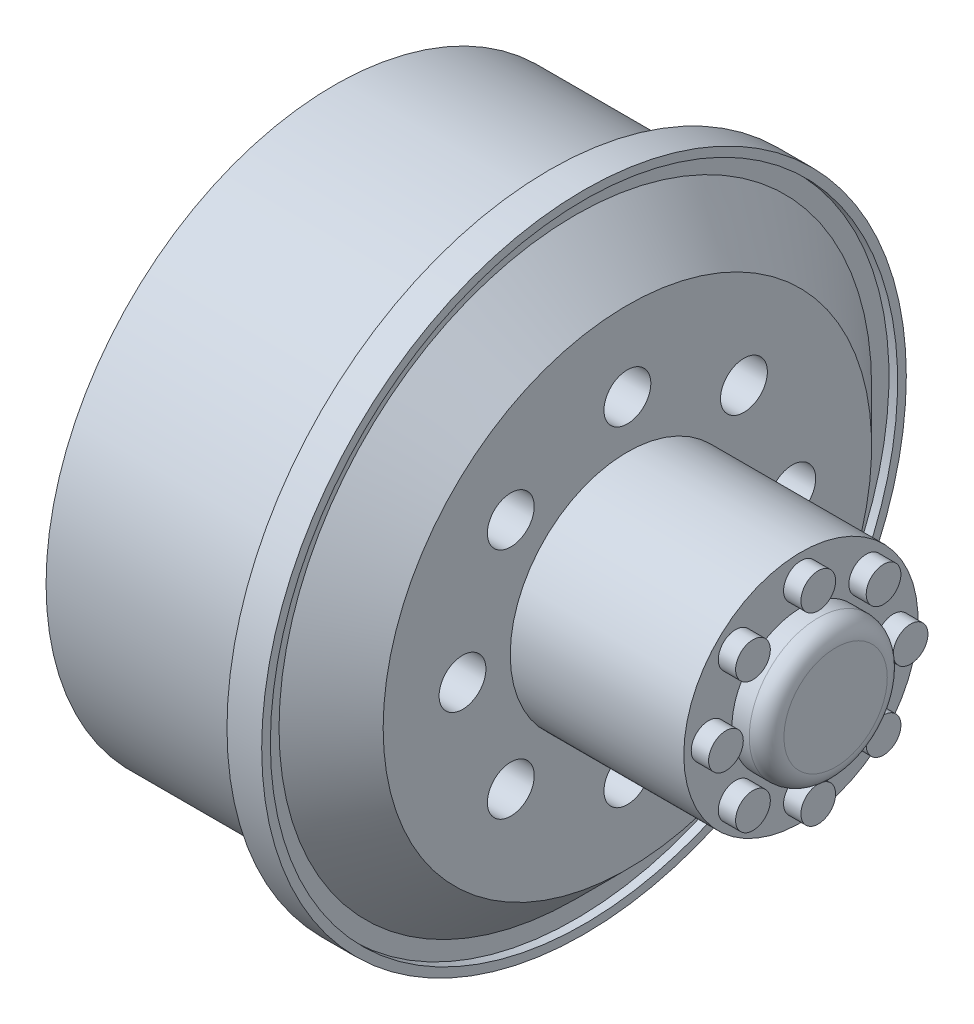
ISO-10303-21;
HEADER;
FILE_DESCRIPTION(('STEP AP214'),'2;1');
FILE_NAME('part.step','',(''),(''),'','','');
FILE_SCHEMA(('AUTOMOTIVE_DESIGN { 1 0 10303 214 1 1 1 1 }'));
ENDSEC;
DATA;
#1=APPLICATION_CONTEXT('core data for automotive mechanical design processes');
#2=APPLICATION_PROTOCOL_DEFINITION('international standard','automotive_design',2000,#1);
#3=PRODUCT_CONTEXT('',#1,'mechanical');
#4=PRODUCT('Part','Part','',(#3));
#5=PRODUCT_RELATED_PRODUCT_CATEGORY('part','',(#4));
#6=PRODUCT_DEFINITION_FORMATION('','',#4);
#7=PRODUCT_DEFINITION_CONTEXT('part definition',#1,'design');
#8=PRODUCT_DEFINITION('design','',#6,#7);
#9=PRODUCT_DEFINITION_SHAPE('','',#8);
#10=(LENGTH_UNIT() NAMED_UNIT(*) SI_UNIT(.MILLI.,.METRE.));
#11=(NAMED_UNIT(*) PLANE_ANGLE_UNIT() SI_UNIT($,.RADIAN.));
#12=(NAMED_UNIT(*) SI_UNIT($,.STERADIAN.) SOLID_ANGLE_UNIT());
#13=UNCERTAINTY_MEASURE_WITH_UNIT(LENGTH_MEASURE(1.E-05),#10,'distance_accuracy_value','');
#14=(GEOMETRIC_REPRESENTATION_CONTEXT(3) GLOBAL_UNCERTAINTY_ASSIGNED_CONTEXT((#13)) GLOBAL_UNIT_ASSIGNED_CONTEXT((#10,
#11,#12)) REPRESENTATION_CONTEXT('',''));
#15=CARTESIAN_POINT('',(0.,0.,0.));
#16=DIRECTION('',(0.,0.,1.));
#17=DIRECTION('',(1.,0.,0.));
#18=AXIS2_PLACEMENT_3D('',#15,#16,#17);
#19=CARTESIAN_POINT('',(19.5913772135329,5.32066793579194,0.));
#20=DIRECTION('',(-1.,0.,0.));
#21=DIRECTION('',(0.,0.,1.));
#22=AXIS2_PLACEMENT_3D('',#19,#20,#21);
#23=CYLINDRICAL_SURFACE('',#22,1.);
#24=CARTESIAN_POINT('',(17.5913772135329,5.32066793579194,0.));
#25=DIRECTION('',(-1.,0.,0.));
#26=DIRECTION('',(0.,0.,1.));
#27=AXIS2_PLACEMENT_3D('',#24,#25,#26);
#28=CIRCLE('',#27,1.);
#29=CARTESIAN_POINT('',(17.5913772135329,5.32066793579194,1.));
#30=VERTEX_POINT('',#29);
#31=EDGE_CURVE('E66',#30,#30,#28,.F.);
#32=ORIENTED_EDGE('',*,*,#31,.T.);
#33=EDGE_LOOP('',(#32));
#34=FACE_BOUND('',#33,.T.);
#35=CARTESIAN_POINT('',(18.5913772135329,5.32066793579194,0.));
#36=DIRECTION('',(1.,0.,0.));
#37=DIRECTION('',(0.,0.,-1.));
#38=AXIS2_PLACEMENT_3D('',#35,#36,#37);
#39=CIRCLE('',#38,1.);
#40=CARTESIAN_POINT('',(18.5913772135329,5.32066793579194,-1.));
#41=VERTEX_POINT('',#40);
#42=EDGE_CURVE('E138',#41,#41,#39,.T.);
#43=ORIENTED_EDGE('',*,*,#42,.F.);
#44=EDGE_LOOP('',(#43));
#45=FACE_BOUND('',#44,.T.);
#46=ADVANCED_FACE('F31',(#34,#45),#23,.T.);
#47=CARTESIAN_POINT('',(19.5913772135329,3.76228037784047,-3.76228037784037));
#48=DIRECTION('',(-1.,0.,0.));
#49=DIRECTION('',(0.,0.,1.));
#50=AXIS2_PLACEMENT_3D('',#47,#48,#49);
#51=CYLINDRICAL_SURFACE('',#50,1.00000000000003);
#52=CARTESIAN_POINT('',(17.5913772135329,3.76228037784047,-3.76228037784037));
#53=DIRECTION('',(-1.,0.,0.));
#54=DIRECTION('',(0.,0.,1.));
#55=AXIS2_PLACEMENT_3D('',#52,#53,#54);
#56=CIRCLE('',#55,1.00000000000003);
#57=CARTESIAN_POINT('',(17.5913772135329,3.76228037784047,-2.76228037784035));
#58=VERTEX_POINT('',#57);
#59=EDGE_CURVE('E63',#58,#58,#56,.F.);
#60=ORIENTED_EDGE('',*,*,#59,.T.);
#61=EDGE_LOOP('',(#60));
#62=FACE_BOUND('',#61,.T.);
#63=CARTESIAN_POINT('',(18.5913772135329,3.76228037784047,-3.76228037784037));
#64=DIRECTION('',(1.,0.,0.));
#65=DIRECTION('',(0.,0.,-1.));
#66=AXIS2_PLACEMENT_3D('',#63,#64,#65);
#67=CIRCLE('',#66,1.00000000000003);
#68=CARTESIAN_POINT('',(18.5913772135329,3.76228037784047,-4.7622803778404));
#69=VERTEX_POINT('',#68);
#70=EDGE_CURVE('E162',#69,#69,#67,.T.);
#71=ORIENTED_EDGE('',*,*,#70,.F.);
#72=EDGE_LOOP('',(#71));
#73=FACE_BOUND('',#72,.T.);
#74=ADVANCED_FACE('F186',(#62,#73),#51,.T.);
#75=CARTESIAN_POINT('',(19.5913772135329,2.25856326226585E-13,-5.32066793579216));
#76=DIRECTION('',(-1.,0.,0.));
#77=DIRECTION('',(0.,0.,1.));
#78=AXIS2_PLACEMENT_3D('',#75,#76,#77);
#79=CYLINDRICAL_SURFACE('',#78,1.00000000000017);
#80=CARTESIAN_POINT('',(17.5913772135329,2.25856326226585E-13,-5.32066793579216));
#81=DIRECTION('',(-1.,0.,0.));
#82=DIRECTION('',(0.,0.,1.));
#83=AXIS2_PLACEMENT_3D('',#80,#81,#82);
#84=CIRCLE('',#83,1.00000000000017);
#85=CARTESIAN_POINT('',(17.5913772135329,2.25856326226585E-13,-4.32066793579199));
#86=VERTEX_POINT('',#85);
#87=EDGE_CURVE('E60',#86,#86,#84,.F.);
#88=ORIENTED_EDGE('',*,*,#87,.T.);
#89=EDGE_LOOP('',(#88));
#90=FACE_BOUND('',#89,.T.);
#91=CARTESIAN_POINT('',(18.5913772135329,2.25856326226585E-13,-5.32066793579216));
#92=DIRECTION('',(1.,0.,0.));
#93=DIRECTION('',(0.,0.,-1.));
#94=AXIS2_PLACEMENT_3D('',#91,#92,#93);
#95=CIRCLE('',#94,1.00000000000017);
#96=CARTESIAN_POINT('',(18.5913772135329,2.25856326226585E-13,-6.32066793579233));
#97=VERTEX_POINT('',#96);
#98=EDGE_CURVE('E178',#97,#97,#95,.T.);
#99=ORIENTED_EDGE('',*,*,#98,.F.);
#100=EDGE_LOOP('',(#99));
#101=FACE_BOUND('',#100,.T.);
#102=ADVANCED_FACE('F188',(#90,#101),#79,.T.);
#103=CARTESIAN_POINT('',(19.5913772135329,-3.76228037784015,-3.76228037784069));
#104=DIRECTION('',(-1.,0.,0.));
#105=DIRECTION('',(0.,0.,1.));
#106=AXIS2_PLACEMENT_3D('',#103,#104,#105);
#107=CYLINDRICAL_SURFACE('',#106,1.00000000000035);
#108=CARTESIAN_POINT('',(17.5913772135329,-3.76228037784015,-3.76228037784069));
#109=DIRECTION('',(-1.,0.,0.));
#110=DIRECTION('',(0.,0.,1.));
#111=AXIS2_PLACEMENT_3D('',#108,#109,#110);
#112=CIRCLE('',#111,1.00000000000035);
#113=CARTESIAN_POINT('',(17.5913772135329,-3.76228037784015,-2.76228037784035));
#114=VERTEX_POINT('',#113);
#115=EDGE_CURVE('E57',#114,#114,#112,.F.);
#116=ORIENTED_EDGE('',*,*,#115,.T.);
#117=EDGE_LOOP('',(#116));
#118=FACE_BOUND('',#117,.T.);
#119=CARTESIAN_POINT('',(18.5913772135329,-3.76228037784015,-3.76228037784069));
#120=DIRECTION('',(1.,0.,0.));
#121=DIRECTION('',(0.,0.,-1.));
#122=AXIS2_PLACEMENT_3D('',#119,#120,#121);
#123=CIRCLE('',#122,1.00000000000035);
#124=CARTESIAN_POINT('',(18.5913772135329,-3.76228037784015,-4.76228037784104));
#125=VERTEX_POINT('',#124);
#126=EDGE_CURVE('E175',#125,#125,#123,.T.);
#127=ORIENTED_EDGE('',*,*,#126,.F.);
#128=EDGE_LOOP('',(#127));
#129=FACE_BOUND('',#128,.T.);
#130=ADVANCED_FACE('F195',(#118,#129),#107,.T.);
#131=CARTESIAN_POINT('',(19.5913772135329,-5.32066793579194,-4.5171265245317E-13));
#132=DIRECTION('',(-1.,0.,0.));
#133=DIRECTION('',(0.,0.,1.));
#134=AXIS2_PLACEMENT_3D('',#131,#132,#133);
#135=CYLINDRICAL_SURFACE('',#134,1.00000000000047);
#136=CARTESIAN_POINT('',(17.5913772135329,-5.32066793579194,-4.5171265245317E-13));
#137=DIRECTION('',(-1.,0.,0.));
#138=DIRECTION('',(0.,0.,1.));
#139=AXIS2_PLACEMENT_3D('',#136,#137,#138);
#140=CIRCLE('',#139,1.00000000000047);
#141=CARTESIAN_POINT('',(17.5913772135329,-5.32066793579194,1.00000000000002));
#142=VERTEX_POINT('',#141);
#143=EDGE_CURVE('E54',#142,#142,#140,.F.);
#144=ORIENTED_EDGE('',*,*,#143,.T.);
#145=EDGE_LOOP('',(#144));
#146=FACE_BOUND('',#145,.T.);
#147=CARTESIAN_POINT('',(18.5913772135329,-5.32066793579194,-4.5171265245317E-13));
#148=DIRECTION('',(1.,0.,0.));
#149=DIRECTION('',(0.,0.,-1.));
#150=AXIS2_PLACEMENT_3D('',#147,#148,#149);
#151=CIRCLE('',#150,1.00000000000047);
#152=CARTESIAN_POINT('',(18.5913772135329,-5.32066793579194,-1.00000000000092));
#153=VERTEX_POINT('',#152);
#154=EDGE_CURVE('E172',#153,#153,#151,.T.);
#155=ORIENTED_EDGE('',*,*,#154,.F.);
#156=EDGE_LOOP('',(#155));
#157=FACE_BOUND('',#156,.T.);
#158=ADVANCED_FACE('F338',(#146,#157),#135,.T.);
#159=CARTESIAN_POINT('',(19.5913772135329,-3.76228037784047,3.76228037783992));
#160=DIRECTION('',(-1.,0.,0.));
#161=DIRECTION('',(0.,0.,1.));
#162=AXIS2_PLACEMENT_3D('',#159,#160,#161);
#163=CYLINDRICAL_SURFACE('',#162,1.00000000000046);
#164=CARTESIAN_POINT('',(17.5913772135329,-3.76228037784047,3.76228037783992));
#165=DIRECTION('',(-1.,0.,0.));
#166=DIRECTION('',(0.,0.,1.));
#167=AXIS2_PLACEMENT_3D('',#164,#165,#166);
#168=CIRCLE('',#167,1.00000000000046);
#169=CARTESIAN_POINT('',(17.5913772135329,-3.76228037784047,4.76228037784038));
#170=VERTEX_POINT('',#169);
#171=EDGE_CURVE('E51',#170,#170,#168,.F.);
#172=ORIENTED_EDGE('',*,*,#171,.T.);
#173=EDGE_LOOP('',(#172));
#174=FACE_BOUND('',#173,.T.);
#175=CARTESIAN_POINT('',(18.5913772135329,-3.76228037784047,3.76228037783992));
#176=DIRECTION('',(1.,0.,0.));
#177=DIRECTION('',(0.,0.,-1.));
#178=AXIS2_PLACEMENT_3D('',#175,#176,#177);
#179=CIRCLE('',#178,1.00000000000046);
#180=CARTESIAN_POINT('',(18.5913772135329,-3.76228037784047,2.76228037783947));
#181=VERTEX_POINT('',#180);
#182=EDGE_CURVE('E169',#181,#181,#179,.T.);
#183=ORIENTED_EDGE('',*,*,#182,.F.);
#184=EDGE_LOOP('',(#183));
#185=FACE_BOUND('',#184,.T.);
#186=ADVANCED_FACE('F328',(#174,#185),#163,.T.);
#187=CARTESIAN_POINT('',(19.5913772135329,-2.26507920122274E-13,5.32066793579171));
#188=DIRECTION('',(-1.,0.,0.));
#189=DIRECTION('',(0.,0.,1.));
#190=AXIS2_PLACEMENT_3D('',#187,#188,#189);
#191=CYLINDRICAL_SURFACE('',#190,1.00000000000034);
#192=CARTESIAN_POINT('',(17.5913772135329,-2.26507920122274E-13,5.32066793579171));
#193=DIRECTION('',(-1.,0.,0.));
#194=DIRECTION('',(0.,0.,1.));
#195=AXIS2_PLACEMENT_3D('',#192,#193,#194);
#196=CIRCLE('',#195,1.00000000000034);
#197=CARTESIAN_POINT('',(17.5913772135329,-2.26507920122274E-13,6.32066793579205));
#198=VERTEX_POINT('',#197);
#199=EDGE_CURVE('E46',#198,#198,#196,.F.);
#200=ORIENTED_EDGE('',*,*,#199,.T.);
#201=EDGE_LOOP('',(#200));
#202=FACE_BOUND('',#201,.T.);
#203=CARTESIAN_POINT('',(18.5913772135329,-2.26507920122274E-13,5.32066793579171));
#204=DIRECTION('',(1.,0.,0.));
#205=DIRECTION('',(0.,0.,-1.));
#206=AXIS2_PLACEMENT_3D('',#203,#204,#205);
#207=CIRCLE('',#206,1.00000000000033);
#208=CARTESIAN_POINT('',(18.5913772135329,-2.26507920122274E-13,4.32066793579138));
#209=VERTEX_POINT('',#208);
#210=EDGE_CURVE('E166',#209,#209,#207,.T.);
#211=ORIENTED_EDGE('',*,*,#210,.F.);
#212=EDGE_LOOP('',(#211));
#213=FACE_BOUND('',#212,.T.);
#214=ADVANCED_FACE('F298',(#202,#213),#191,.T.);
#215=CARTESIAN_POINT('',(19.5913772135329,3.76228037784015,3.76228037784024));
#216=DIRECTION('',(-1.,0.,0.));
#217=DIRECTION('',(0.,0.,1.));
#218=AXIS2_PLACEMENT_3D('',#215,#216,#217);
#219=CYLINDRICAL_SURFACE('',#218,1.00000000000017);
#220=CARTESIAN_POINT('',(17.5913772135329,3.76228037784015,3.76228037784024));
#221=DIRECTION('',(-1.,0.,0.));
#222=DIRECTION('',(0.,0.,1.));
#223=AXIS2_PLACEMENT_3D('',#220,#221,#222);
#224=CIRCLE('',#223,1.00000000000017);
#225=CARTESIAN_POINT('',(17.5913772135329,3.76228037784015,4.76228037784042));
#226=VERTEX_POINT('',#225);
#227=EDGE_CURVE('E42',#226,#226,#224,.F.);
#228=ORIENTED_EDGE('',*,*,#227,.T.);
#229=EDGE_LOOP('',(#228));
#230=FACE_BOUND('',#229,.T.);
#231=CARTESIAN_POINT('',(18.5913772135329,3.76228037784015,3.76228037784024));
#232=DIRECTION('',(1.,0.,0.));
#233=DIRECTION('',(0.,0.,-1.));
#234=AXIS2_PLACEMENT_3D('',#231,#232,#233);
#235=CIRCLE('',#234,1.00000000000017);
#236=CARTESIAN_POINT('',(18.5913772135329,3.76228037784015,2.76228037784007));
#237=VERTEX_POINT('',#236);
#238=EDGE_CURVE('E163',#237,#237,#235,.T.);
#239=ORIENTED_EDGE('',*,*,#238,.F.);
#240=EDGE_LOOP('',(#239));
#241=FACE_BOUND('',#240,.T.);
#242=ADVANCED_FACE('F293',(#230,#241),#219,.T.);
#243=CARTESIAN_POINT('',(-9.30862278646706,14.6,0.));
#244=DIRECTION('',(1.,0.,0.));
#245=DIRECTION('',(0.,0.,-1.));
#246=AXIS2_PLACEMENT_3D('',#243,#244,#245);
#247=PLANE('',#246);
#248=CARTESIAN_POINT('',(-9.30862278646706,0.,0.));
#249=DIRECTION('',(-1.,0.,0.));
#250=DIRECTION('',(0.,0.,1.));
#251=AXIS2_PLACEMENT_3D('',#248,#249,#250);
#252=CIRCLE('',#251,14.6);
#253=CARTESIAN_POINT('',(-9.30862278646706,0.,14.6));
#254=VERTEX_POINT('',#253);
#255=EDGE_CURVE('E106',#254,#254,#252,.T.);
#256=ORIENTED_EDGE('',*,*,#255,.F.);
#257=EDGE_LOOP('',(#256));
#258=FACE_BOUND('',#257,.T.);
#259=CARTESIAN_POINT('',(-9.30862278646706,0.,0.));
#260=DIRECTION('',(-1.,0.,0.));
#261=DIRECTION('',(0.,0.,1.));
#262=AXIS2_PLACEMENT_3D('',#259,#260,#261);
#263=CIRCLE('',#262,16.6);
#264=CARTESIAN_POINT('',(-9.30862278646706,0.,16.6));
#265=VERTEX_POINT('',#264);
#266=EDGE_CURVE('E70',#265,#265,#263,.T.);
#267=ORIENTED_EDGE('',*,*,#266,.T.);
#268=EDGE_LOOP('',(#267));
#269=FACE_BOUND('',#268,.T.);
#270=ADVANCED_FACE('F290',(#258,#269),#247,.F.);
#271=CARTESIAN_POINT('',(-25.,0.,0.));
#272=DIRECTION('',(-1.,0.,0.));
#273=DIRECTION('',(0.,0.,1.));
#274=AXIS2_PLACEMENT_3D('',#271,#272,#273);
#275=CYLINDRICAL_SURFACE('',#274,16.6);
#276=ORIENTED_EDGE('',*,*,#266,.F.);
#277=EDGE_LOOP('',(#276));
#278=FACE_BOUND('',#277,.T.);
#279=CARTESIAN_POINT('',(3.09137721353294,0.,0.));
#280=DIRECTION('',(-1.,0.,0.));
#281=DIRECTION('',(0.,0.,1.));
#282=AXIS2_PLACEMENT_3D('',#279,#280,#281);
#283=CIRCLE('',#282,16.6);
#284=CARTESIAN_POINT('',(3.09137721353294,0.,16.6));
#285=VERTEX_POINT('',#284);
#286=EDGE_CURVE('E73',#285,#285,#283,.T.);
#287=ORIENTED_EDGE('',*,*,#286,.T.);
#288=EDGE_LOOP('',(#287));
#289=FACE_BOUND('',#288,.T.);
#290=ADVANCED_FACE('F287',(#278,#289),#275,.T.);
#291=CARTESIAN_POINT('',(3.09137721353294,16.6,0.));
#292=DIRECTION('',(1.,0.,0.));
#293=DIRECTION('',(0.,0.,-1.));
#294=AXIS2_PLACEMENT_3D('',#291,#292,#293);
#295=PLANE('',#294);
#296=ORIENTED_EDGE('',*,*,#286,.F.);
#297=EDGE_LOOP('',(#296));
#298=FACE_BOUND('',#297,.T.);
#299=CARTESIAN_POINT('',(3.09137721353294,0.,0.));
#300=DIRECTION('',(-1.,0.,0.));
#301=DIRECTION('',(0.,0.,1.));
#302=AXIS2_PLACEMENT_3D('',#299,#300,#301);
#303=CIRCLE('',#302,18.5746397897898);
#304=CARTESIAN_POINT('',(3.09137721353294,0.,18.5746397897898));
#305=VERTEX_POINT('',#304);
#306=EDGE_CURVE('E76',#305,#305,#303,.T.);
#307=ORIENTED_EDGE('',*,*,#306,.T.);
#308=EDGE_LOOP('',(#307));
#309=FACE_BOUND('',#308,.T.);
#310=ADVANCED_FACE('F283',(#298,#309),#295,.F.);
#311=CARTESIAN_POINT('',(-25.,0.,0.));
#312=DIRECTION('',(-1.,0.,0.));
#313=DIRECTION('',(0.,0.,1.));
#314=AXIS2_PLACEMENT_3D('',#311,#312,#313);
#315=CYLINDRICAL_SURFACE('',#314,18.5746397897898);
#316=ORIENTED_EDGE('',*,*,#306,.F.);
#317=EDGE_LOOP('',(#316));
#318=FACE_BOUND('',#317,.T.);
#319=CARTESIAN_POINT('',(5.09137721353294,0.,0.));
#320=DIRECTION('',(-1.,0.,0.));
#321=DIRECTION('',(0.,0.,1.));
#322=AXIS2_PLACEMENT_3D('',#319,#320,#321);
#323=CIRCLE('',#322,18.5746397897898);
#324=CARTESIAN_POINT('',(5.09137721353294,0.,18.5746397897898));
#325=VERTEX_POINT('',#324);
#326=EDGE_CURVE('E79',#325,#325,#323,.T.);
#327=ORIENTED_EDGE('',*,*,#326,.T.);
#328=EDGE_LOOP('',(#327));
#329=FACE_BOUND('',#328,.T.);
#330=ADVANCED_FACE('F279',(#318,#329),#315,.T.);
#331=CARTESIAN_POINT('',(5.09137721353294,18.5746397897898,0.));
#332=DIRECTION('',(-1.,0.,0.));
#333=DIRECTION('',(0.,0.,1.));
#334=AXIS2_PLACEMENT_3D('',#331,#332,#333);
#335=PLANE('',#334);
#336=ORIENTED_EDGE('',*,*,#326,.F.);
#337=EDGE_LOOP('',(#336));
#338=FACE_BOUND('',#337,.T.);
#339=CARTESIAN_POINT('',(5.09137721353294,0.,0.));
#340=DIRECTION('',(-1.,0.,0.));
#341=DIRECTION('',(0.,0.,1.));
#342=AXIS2_PLACEMENT_3D('',#339,#340,#341);
#343=CIRCLE('',#342,18.0746397897898);
#344=CARTESIAN_POINT('',(5.09137721353294,0.,18.0746397897898));
#345=VERTEX_POINT('',#344);
#346=EDGE_CURVE('E82',#345,#345,#343,.T.);
#347=ORIENTED_EDGE('',*,*,#346,.T.);
#348=EDGE_LOOP('',(#347));
#349=FACE_BOUND('',#348,.T.);
#350=ADVANCED_FACE('F275',(#338,#349),#335,.F.);
#351=CARTESIAN_POINT('',(-25.,0.,0.));
#352=DIRECTION('',(-1.,0.,0.));
#353=DIRECTION('',(0.,0.,1.));
#354=AXIS2_PLACEMENT_3D('',#351,#352,#353);
#355=CYLINDRICAL_SURFACE('',#354,18.0746397897898);
#356=ORIENTED_EDGE('',*,*,#346,.F.);
#357=EDGE_LOOP('',(#356));
#358=FACE_BOUND('',#357,.T.);
#359=CARTESIAN_POINT('',(4.59137721353294,0.,0.));
#360=DIRECTION('',(-1.,0.,0.));
#361=DIRECTION('',(0.,0.,1.));
#362=AXIS2_PLACEMENT_3D('',#359,#360,#361);
#363=CIRCLE('',#362,18.0746397897898);
#364=CARTESIAN_POINT('',(4.59137721353294,0.,18.0746397897898));
#365=VERTEX_POINT('',#364);
#366=EDGE_CURVE('E85',#365,#365,#363,.T.);
#367=ORIENTED_EDGE('',*,*,#366,.T.);
#368=EDGE_LOOP('',(#367));
#369=FACE_BOUND('',#368,.T.);
#370=ADVANCED_FACE('F271',(#358,#369),#355,.F.);
#371=CARTESIAN_POINT('',(4.59137721353294,18.0746397897898,0.));
#372=DIRECTION('',(-1.,0.,0.));
#373=DIRECTION('',(0.,0.,1.));
#374=AXIS2_PLACEMENT_3D('',#371,#372,#373);
#375=PLANE('',#374);
#376=ORIENTED_EDGE('',*,*,#366,.F.);
#377=EDGE_LOOP('',(#376));
#378=FACE_BOUND('',#377,.T.);
#379=CARTESIAN_POINT('',(4.59137721353294,0.,0.));
#380=DIRECTION('',(-1.,0.,0.));
#381=DIRECTION('',(0.,0.,1.));
#382=AXIS2_PLACEMENT_3D('',#379,#380,#381);
#383=CIRCLE('',#382,17.0746397897898);
#384=CARTESIAN_POINT('',(4.59137721353294,0.,17.0746397897898));
#385=VERTEX_POINT('',#384);
#386=EDGE_CURVE('E88',#385,#385,#383,.T.);
#387=ORIENTED_EDGE('',*,*,#386,.T.);
#388=EDGE_LOOP('',(#387));
#389=FACE_BOUND('',#388,.T.);
#390=ADVANCED_FACE('F267',(#378,#389),#375,.F.);
#391=CARTESIAN_POINT('',(7.59137721353294,0.,0.));
#392=DIRECTION('',(-1.,0.,0.));
#393=DIRECTION('',(0.,0.,1.));
#394=AXIS2_PLACEMENT_3D('',#391,#392,#393);
#395=CONICAL_SURFACE('',#394,14.0746397897898,0.785398163397447);
#396=ORIENTED_EDGE('',*,*,#386,.F.);
#397=EDGE_LOOP('',(#396));
#398=FACE_BOUND('',#397,.T.);
#399=CARTESIAN_POINT('',(7.59137721353294,0.,0.));
#400=DIRECTION('',(-1.,0.,0.));
#401=DIRECTION('',(0.,0.,1.));
#402=AXIS2_PLACEMENT_3D('',#399,#400,#401);
#403=CIRCLE('',#402,14.0746397897898);
#404=CARTESIAN_POINT('',(7.59137721353294,0.,14.0746397897898));
#405=VERTEX_POINT('',#404);
#406=EDGE_CURVE('E91',#405,#405,#403,.T.);
#407=ORIENTED_EDGE('',*,*,#406,.T.);
#408=EDGE_LOOP('',(#407));
#409=FACE_BOUND('',#408,.T.);
#410=ADVANCED_FACE('F263',(#398,#409),#395,.T.);
#411=CARTESIAN_POINT('',(7.59137721353294,14.0746397897898,0.));
#412=DIRECTION('',(-1.,0.,0.));
#413=DIRECTION('',(0.,0.,1.));
#414=AXIS2_PLACEMENT_3D('',#411,#412,#413);
#415=PLANE('',#414);
#416=CARTESIAN_POINT('',(7.59137721353294,9.5,0.));
#417=DIRECTION('',(-1.,0.,0.));
#418=DIRECTION('',(0.,0.,1.));
#419=AXIS2_PLACEMENT_3D('',#416,#417,#418);
#420=CIRCLE('',#419,1.35);
#421=CARTESIAN_POINT('',(7.59137721353294,9.5,1.35));
#422=VERTEX_POINT('',#421);
#423=EDGE_CURVE('E109',#422,#422,#420,.T.);
#424=ORIENTED_EDGE('',*,*,#423,.T.);
#425=EDGE_LOOP('',(#424));
#426=FACE_BOUND('',#425,.T.);
#427=CARTESIAN_POINT('',(7.59137721353294,6.71751442127249,6.71751442127232));
#428=DIRECTION('',(-1.,0.,0.));
#429=DIRECTION('',(0.,0.,1.));
#430=AXIS2_PLACEMENT_3D('',#427,#428,#429);
#431=CIRCLE('',#430,1.35000000000005);
#432=CARTESIAN_POINT('',(7.59137721353294,6.71751442127249,8.06751442127237));
#433=VERTEX_POINT('',#432);
#434=EDGE_CURVE('E112',#433,#433,#431,.T.);
#435=ORIENTED_EDGE('',*,*,#434,.T.);
#436=EDGE_LOOP('',(#435));
#437=FACE_BOUND('',#436,.T.);
#438=CARTESIAN_POINT('',(7.59137721353294,4.03264237694472E-13,9.5000000000004));
#439=DIRECTION('',(-1.,0.,0.));
#440=DIRECTION('',(0.,0.,1.));
#441=AXIS2_PLACEMENT_3D('',#438,#439,#440);
#442=CIRCLE('',#441,1.3500000000003);
#443=CARTESIAN_POINT('',(7.59137721353294,4.03264237694472E-13,10.8500000000007));
#444=VERTEX_POINT('',#443);
#445=EDGE_CURVE('E115',#444,#444,#442,.T.);
#446=ORIENTED_EDGE('',*,*,#445,.T.);
#447=EDGE_LOOP('',(#446));
#448=FACE_BOUND('',#447,.T.);
#449=CARTESIAN_POINT('',(7.59137721353294,-6.71751442127192,6.71751442127289));
#450=DIRECTION('',(-1.,0.,0.));
#451=DIRECTION('',(0.,0.,1.));
#452=AXIS2_PLACEMENT_3D('',#449,#450,#451);
#453=CIRCLE('',#452,1.35000000000062);
#454=CARTESIAN_POINT('',(7.59137721353294,-6.71751442127192,8.06751442127351));
#455=VERTEX_POINT('',#454);
#456=EDGE_CURVE('E118',#455,#455,#453,.T.);
#457=ORIENTED_EDGE('',*,*,#456,.T.);
#458=EDGE_LOOP('',(#457));
#459=FACE_BOUND('',#458,.T.);
#460=CARTESIAN_POINT('',(7.59137721353294,-9.5,8.06528475388944E-13));
#461=DIRECTION('',(-1.,0.,0.));
#462=DIRECTION('',(0.,0.,1.));
#463=AXIS2_PLACEMENT_3D('',#460,#461,#462);
#464=CIRCLE('',#463,1.35000000000083);
#465=CARTESIAN_POINT('',(7.59137721353294,-9.5,1.35000000000164));
#466=VERTEX_POINT('',#465);
#467=EDGE_CURVE('E121',#466,#466,#464,.T.);
#468=ORIENTED_EDGE('',*,*,#467,.T.);
#469=EDGE_LOOP('',(#468));
#470=FACE_BOUND('',#469,.T.);
#471=CARTESIAN_POINT('',(7.59137721353294,-6.71751442127249,-6.71751442127151));
#472=DIRECTION('',(-1.,0.,0.));
#473=DIRECTION('',(0.,0.,1.));
#474=AXIS2_PLACEMENT_3D('',#471,#472,#473);
#475=CIRCLE('',#474,1.35000000000082);
#476=CARTESIAN_POINT('',(7.59137721353294,-6.71751442127249,-5.3675144212707));
#477=VERTEX_POINT('',#476);
#478=EDGE_CURVE('E124',#477,#477,#475,.T.);
#479=ORIENTED_EDGE('',*,*,#478,.T.);
#480=EDGE_LOOP('',(#479));
#481=FACE_BOUND('',#480,.T.);
#482=CARTESIAN_POINT('',(7.59137721353294,-4.04427652153662E-13,-9.4999999999996));
#483=DIRECTION('',(-1.,0.,0.));
#484=DIRECTION('',(0.,0.,1.));
#485=AXIS2_PLACEMENT_3D('',#482,#483,#484);
#486=CIRCLE('',#485,1.3500000000006);
#487=CARTESIAN_POINT('',(7.59137721353294,-4.04427652153662E-13,-8.149999999999));
#488=VERTEX_POINT('',#487);
#489=EDGE_CURVE('E127',#488,#488,#486,.T.);
#490=ORIENTED_EDGE('',*,*,#489,.T.);
#491=EDGE_LOOP('',(#490));
#492=FACE_BOUND('',#491,.T.);
#493=CARTESIAN_POINT('',(7.59137721353294,6.71751442127191,-6.71751442127209));
#494=DIRECTION('',(-1.,0.,0.));
#495=DIRECTION('',(0.,0.,1.));
#496=AXIS2_PLACEMENT_3D('',#493,#494,#495);
#497=CIRCLE('',#496,1.35000000000031);
#498=CARTESIAN_POINT('',(7.59137721353294,6.71751442127191,-5.36751442127178));
#499=VERTEX_POINT('',#498);
#500=EDGE_CURVE('E130',#499,#499,#497,.T.);
#501=ORIENTED_EDGE('',*,*,#500,.T.);
#502=EDGE_LOOP('',(#501));
#503=FACE_BOUND('',#502,.T.);
#504=ORIENTED_EDGE('',*,*,#406,.F.);
#505=EDGE_LOOP('',(#504));
#506=FACE_BOUND('',#505,.T.);
#507=CARTESIAN_POINT('',(7.59137721353294,0.,0.));
#508=DIRECTION('',(-1.,0.,0.));
#509=DIRECTION('',(0.,0.,1.));
#510=AXIS2_PLACEMENT_3D('',#507,#508,#509);
#511=CIRCLE('',#510,6.75);
#512=CARTESIAN_POINT('',(7.59137721353294,0.,6.75));
#513=VERTEX_POINT('',#512);
#514=EDGE_CURVE('E94',#513,#513,#511,.T.);
#515=ORIENTED_EDGE('',*,*,#514,.T.);
#516=EDGE_LOOP('',(#515));
#517=FACE_BOUND('',#516,.T.);
#518=ADVANCED_FACE('F259',(#426,#437,#448,#459,#470,#481,#492,#503,#506,#517),#415,.F.);
#519=CARTESIAN_POINT('',(-25.,0.,0.));
#520=DIRECTION('',(-1.,0.,0.));
#521=DIRECTION('',(0.,0.,1.));
#522=AXIS2_PLACEMENT_3D('',#519,#520,#521);
#523=CYLINDRICAL_SURFACE('',#522,6.75);
#524=ORIENTED_EDGE('',*,*,#514,.F.);
#525=EDGE_LOOP('',(#524));
#526=FACE_BOUND('',#525,.T.);
#527=CARTESIAN_POINT('',(17.5913772135329,0.,0.));
#528=DIRECTION('',(-1.,0.,0.));
#529=DIRECTION('',(0.,0.,1.));
#530=AXIS2_PLACEMENT_3D('',#527,#528,#529);
#531=CIRCLE('',#530,6.75);
#532=CARTESIAN_POINT('',(17.5913772135329,0.,6.75));
#533=VERTEX_POINT('',#532);
#534=EDGE_CURVE('E97',#533,#533,#531,.T.);
#535=ORIENTED_EDGE('',*,*,#534,.T.);
#536=EDGE_LOOP('',(#535));
#537=FACE_BOUND('',#536,.T.);
#538=ADVANCED_FACE('F255',(#526,#537),#523,.T.);
#539=CARTESIAN_POINT('',(17.5913772135329,6.75,0.));
#540=DIRECTION('',(-1.,0.,0.));
#541=DIRECTION('',(0.,0.,1.));
#542=AXIS2_PLACEMENT_3D('',#539,#540,#541);
#543=PLANE('',#542);
#544=ORIENTED_EDGE('',*,*,#227,.F.);
#545=EDGE_LOOP('',(#544));
#546=FACE_BOUND('',#545,.T.);
#547=ORIENTED_EDGE('',*,*,#199,.F.);
#548=EDGE_LOOP('',(#547));
#549=FACE_BOUND('',#548,.T.);
#550=ORIENTED_EDGE('',*,*,#171,.F.);
#551=EDGE_LOOP('',(#550));
#552=FACE_BOUND('',#551,.T.);
#553=ORIENTED_EDGE('',*,*,#143,.F.);
#554=EDGE_LOOP('',(#553));
#555=FACE_BOUND('',#554,.T.);
#556=ORIENTED_EDGE('',*,*,#115,.F.);
#557=EDGE_LOOP('',(#556));
#558=FACE_BOUND('',#557,.T.);
#559=ORIENTED_EDGE('',*,*,#87,.F.);
#560=EDGE_LOOP('',(#559));
#561=FACE_BOUND('',#560,.T.);
#562=ORIENTED_EDGE('',*,*,#59,.F.);
#563=EDGE_LOOP('',(#562));
#564=FACE_BOUND('',#563,.T.);
#565=ORIENTED_EDGE('',*,*,#31,.F.);
#566=EDGE_LOOP('',(#565));
#567=FACE_BOUND('',#566,.T.);
#568=CARTESIAN_POINT('',(17.5913772135329,0.,0.));
#569=DIRECTION('',(1.,0.,0.));
#570=DIRECTION('',(0.,0.,-1.));
#571=AXIS2_PLACEMENT_3D('',#568,#569,#570);
#572=CIRCLE('',#571,3.97713701538208);
#573=CARTESIAN_POINT('',(17.5913772135329,0.,-3.97713701538208));
#574=VERTEX_POINT('',#573);
#575=EDGE_CURVE('E69',#574,#574,#572,.T.);
#576=ORIENTED_EDGE('',*,*,#575,.F.);
#577=EDGE_LOOP('',(#576));
#578=FACE_BOUND('',#577,.T.);
#579=ORIENTED_EDGE('',*,*,#534,.F.);
#580=EDGE_LOOP('',(#579));
#581=FACE_BOUND('',#580,.T.);
#582=ADVANCED_FACE('F251',(#546,#549,#552,#555,#558,#561,#564,#567,#578,#581),#543,.F.);
#583=CARTESIAN_POINT('',(5.59137721353294,13.2462126650436,0.));
#584=DIRECTION('',(1.,0.,0.));
#585=DIRECTION('',(0.,0.,-1.));
#586=AXIS2_PLACEMENT_3D('',#583,#584,#585);
#587=PLANE('',#586);
#588=CARTESIAN_POINT('',(5.59137721353294,9.5,0.));
#589=DIRECTION('',(-1.,0.,0.));
#590=DIRECTION('',(0.,0.,1.));
#591=AXIS2_PLACEMENT_3D('',#588,#589,#590);
#592=CIRCLE('',#591,1.35);
#593=CARTESIAN_POINT('',(5.59137721353294,9.5,1.35));
#594=VERTEX_POINT('',#593);
#595=EDGE_CURVE('E133',#594,#594,#592,.T.);
#596=ORIENTED_EDGE('',*,*,#595,.F.);
#597=EDGE_LOOP('',(#596));
#598=FACE_BOUND('',#597,.T.);
#599=CARTESIAN_POINT('',(5.59137721353294,6.71751442127249,6.71751442127232));
#600=DIRECTION('',(-1.,0.,0.));
#601=DIRECTION('',(0.,0.,1.));
#602=AXIS2_PLACEMENT_3D('',#599,#600,#601);
#603=CIRCLE('',#602,1.35000000000005);
#604=CARTESIAN_POINT('',(5.59137721353294,6.71751442127249,8.06751442127237));
#605=VERTEX_POINT('',#604);
#606=EDGE_CURVE('E153',#605,#605,#603,.T.);
#607=ORIENTED_EDGE('',*,*,#606,.F.);
#608=EDGE_LOOP('',(#607));
#609=FACE_BOUND('',#608,.T.);
#610=CARTESIAN_POINT('',(5.59137721353294,4.03264237694472E-13,9.5000000000004));
#611=DIRECTION('',(-1.,0.,0.));
#612=DIRECTION('',(0.,0.,1.));
#613=AXIS2_PLACEMENT_3D('',#610,#611,#612);
#614=CIRCLE('',#613,1.3500000000003);
#615=CARTESIAN_POINT('',(5.59137721353294,4.03264237694472E-13,10.8500000000007));
#616=VERTEX_POINT('',#615);
#617=EDGE_CURVE('E150',#616,#616,#614,.T.);
#618=ORIENTED_EDGE('',*,*,#617,.F.);
#619=EDGE_LOOP('',(#618));
#620=FACE_BOUND('',#619,.T.);
#621=CARTESIAN_POINT('',(5.59137721353294,-6.71751442127192,6.71751442127289));
#622=DIRECTION('',(-1.,0.,0.));
#623=DIRECTION('',(0.,0.,1.));
#624=AXIS2_PLACEMENT_3D('',#621,#622,#623);
#625=CIRCLE('',#624,1.35000000000062);
#626=CARTESIAN_POINT('',(5.59137721353294,-6.71751442127192,8.06751442127351));
#627=VERTEX_POINT('',#626);
#628=EDGE_CURVE('E147',#627,#627,#625,.T.);
#629=ORIENTED_EDGE('',*,*,#628,.F.);
#630=EDGE_LOOP('',(#629));
#631=FACE_BOUND('',#630,.T.);
#632=CARTESIAN_POINT('',(5.59137721353294,-9.5,8.06528475388944E-13));
#633=DIRECTION('',(-1.,0.,0.));
#634=DIRECTION('',(0.,0.,1.));
#635=AXIS2_PLACEMENT_3D('',#632,#633,#634);
#636=CIRCLE('',#635,1.35000000000083);
#637=CARTESIAN_POINT('',(5.59137721353294,-9.5,1.35000000000164));
#638=VERTEX_POINT('',#637);
#639=EDGE_CURVE('E144',#638,#638,#636,.T.);
#640=ORIENTED_EDGE('',*,*,#639,.F.);
#641=EDGE_LOOP('',(#640));
#642=FACE_BOUND('',#641,.T.);
#643=CARTESIAN_POINT('',(5.59137721353294,-6.71751442127249,-6.71751442127151));
#644=DIRECTION('',(-1.,0.,0.));
#645=DIRECTION('',(0.,0.,1.));
#646=AXIS2_PLACEMENT_3D('',#643,#644,#645);
#647=CIRCLE('',#646,1.35000000000082);
#648=CARTESIAN_POINT('',(5.59137721353294,-6.71751442127249,-5.3675144212707));
#649=VERTEX_POINT('',#648);
#650=EDGE_CURVE('E141',#649,#649,#647,.T.);
#651=ORIENTED_EDGE('',*,*,#650,.F.);
#652=EDGE_LOOP('',(#651));
#653=FACE_BOUND('',#652,.T.);
#654=CARTESIAN_POINT('',(5.59137721353294,-4.04427652153662E-13,-9.4999999999996));
#655=DIRECTION('',(-1.,0.,0.));
#656=DIRECTION('',(0.,0.,1.));
#657=AXIS2_PLACEMENT_3D('',#654,#655,#656);
#658=CIRCLE('',#657,1.3500000000006);
#659=CARTESIAN_POINT('',(5.59137721353294,-4.04427652153662E-13,-8.149999999999));
#660=VERTEX_POINT('',#659);
#661=EDGE_CURVE('E137',#660,#660,#658,.T.);
#662=ORIENTED_EDGE('',*,*,#661,.F.);
#663=EDGE_LOOP('',(#662));
#664=FACE_BOUND('',#663,.T.);
#665=CARTESIAN_POINT('',(5.59137721353294,6.71751442127191,-6.71751442127209));
#666=DIRECTION('',(-1.,0.,0.));
#667=DIRECTION('',(0.,0.,1.));
#668=AXIS2_PLACEMENT_3D('',#665,#666,#667);
#669=CIRCLE('',#668,1.35000000000031);
#670=CARTESIAN_POINT('',(5.59137721353294,6.71751442127191,-5.36751442127178));
#671=VERTEX_POINT('',#670);
#672=EDGE_CURVE('E134',#671,#671,#669,.T.);
#673=ORIENTED_EDGE('',*,*,#672,.F.);
#674=EDGE_LOOP('',(#673));
#675=FACE_BOUND('',#674,.T.);
#676=CARTESIAN_POINT('',(5.59137721353294,0.,0.));
#677=DIRECTION('',(-1.,0.,0.));
#678=DIRECTION('',(0.,0.,1.));
#679=AXIS2_PLACEMENT_3D('',#676,#677,#678);
#680=CIRCLE('',#679,13.2462126650436);
#681=CARTESIAN_POINT('',(5.59137721353294,0.,13.2462126650436));
#682=VERTEX_POINT('',#681);
#683=EDGE_CURVE('E100',#682,#682,#680,.T.);
#684=ORIENTED_EDGE('',*,*,#683,.T.);
#685=EDGE_LOOP('',(#684));
#686=FACE_BOUND('',#685,.T.);
#687=ADVANCED_FACE('F247',(#598,#609,#620,#631,#642,#653,#664,#675,#686),#587,.F.);
#688=CARTESIAN_POINT('',(4.23758987857654,0.,0.));
#689=DIRECTION('',(-1.,0.,0.));
#690=DIRECTION('',(0.,0.,1.));
#691=AXIS2_PLACEMENT_3D('',#688,#689,#690);
#692=CONICAL_SURFACE('',#691,14.6,0.785398163397448);
#693=ORIENTED_EDGE('',*,*,#683,.F.);
#694=EDGE_LOOP('',(#693));
#695=FACE_BOUND('',#694,.T.);
#696=CARTESIAN_POINT('',(4.23758987857654,0.,0.));
#697=DIRECTION('',(-1.,0.,0.));
#698=DIRECTION('',(0.,0.,1.));
#699=AXIS2_PLACEMENT_3D('',#696,#697,#698);
#700=CIRCLE('',#699,14.6);
#701=CARTESIAN_POINT('',(4.23758987857654,0.,14.6));
#702=VERTEX_POINT('',#701);
#703=EDGE_CURVE('E103',#702,#702,#700,.T.);
#704=ORIENTED_EDGE('',*,*,#703,.T.);
#705=EDGE_LOOP('',(#704));
#706=FACE_BOUND('',#705,.T.);
#707=ADVANCED_FACE('F243',(#695,#706),#692,.F.);
#708=CARTESIAN_POINT('',(-25.,0.,0.));
#709=DIRECTION('',(-1.,0.,0.));
#710=DIRECTION('',(0.,0.,1.));
#711=AXIS2_PLACEMENT_3D('',#708,#709,#710);
#712=CYLINDRICAL_SURFACE('',#711,14.6);
#713=ORIENTED_EDGE('',*,*,#703,.F.);
#714=EDGE_LOOP('',(#713));
#715=FACE_BOUND('',#714,.T.);
#716=ORIENTED_EDGE('',*,*,#255,.T.);
#717=EDGE_LOOP('',(#716));
#718=FACE_BOUND('',#717,.T.);
#719=ADVANCED_FACE('F239',(#715,#718),#712,.F.);
#720=CARTESIAN_POINT('',(15.5913772135329,6.71751442127191,-6.71751442127209));
#721=DIRECTION('',(-1.,0.,0.));
#722=DIRECTION('',(0.,0.,1.));
#723=AXIS2_PLACEMENT_3D('',#720,#721,#722);
#724=CYLINDRICAL_SURFACE('',#723,1.35000000000031);
#725=ORIENTED_EDGE('',*,*,#672,.T.);
#726=EDGE_LOOP('',(#725));
#727=FACE_BOUND('',#726,.T.);
#728=ORIENTED_EDGE('',*,*,#500,.F.);
#729=EDGE_LOOP('',(#728));
#730=FACE_BOUND('',#729,.T.);
#731=ADVANCED_FACE('F235',(#727,#730),#724,.F.);
#732=CARTESIAN_POINT('',(15.5913772135329,-4.04427652153662E-13,-9.4999999999996));
#733=DIRECTION('',(-1.,0.,0.));
#734=DIRECTION('',(0.,0.,1.));
#735=AXIS2_PLACEMENT_3D('',#732,#733,#734);
#736=CYLINDRICAL_SURFACE('',#735,1.3500000000006);
#737=ORIENTED_EDGE('',*,*,#661,.T.);
#738=EDGE_LOOP('',(#737));
#739=FACE_BOUND('',#738,.T.);
#740=ORIENTED_EDGE('',*,*,#489,.F.);
#741=EDGE_LOOP('',(#740));
#742=FACE_BOUND('',#741,.T.);
#743=ADVANCED_FACE('F231',(#739,#742),#736,.F.);
#744=CARTESIAN_POINT('',(15.5913772135329,-6.71751442127249,-6.71751442127151));
#745=DIRECTION('',(-1.,0.,0.));
#746=DIRECTION('',(0.,0.,1.));
#747=AXIS2_PLACEMENT_3D('',#744,#745,#746);
#748=CYLINDRICAL_SURFACE('',#747,1.35000000000082);
#749=ORIENTED_EDGE('',*,*,#650,.T.);
#750=EDGE_LOOP('',(#749));
#751=FACE_BOUND('',#750,.T.);
#752=ORIENTED_EDGE('',*,*,#478,.F.);
#753=EDGE_LOOP('',(#752));
#754=FACE_BOUND('',#753,.T.);
#755=ADVANCED_FACE('F227',(#751,#754),#748,.F.);
#756=CARTESIAN_POINT('',(15.5913772135329,-9.5,8.06528475388944E-13));
#757=DIRECTION('',(-1.,0.,0.));
#758=DIRECTION('',(0.,0.,1.));
#759=AXIS2_PLACEMENT_3D('',#756,#757,#758);
#760=CYLINDRICAL_SURFACE('',#759,1.35000000000083);
#761=ORIENTED_EDGE('',*,*,#639,.T.);
#762=EDGE_LOOP('',(#761));
#763=FACE_BOUND('',#762,.T.);
#764=ORIENTED_EDGE('',*,*,#467,.F.);
#765=EDGE_LOOP('',(#764));
#766=FACE_BOUND('',#765,.T.);
#767=ADVANCED_FACE('F223',(#763,#766),#760,.F.);
#768=CARTESIAN_POINT('',(15.5913772135329,-6.71751442127192,6.71751442127289));
#769=DIRECTION('',(-1.,0.,0.));
#770=DIRECTION('',(0.,0.,1.));
#771=AXIS2_PLACEMENT_3D('',#768,#769,#770);
#772=CYLINDRICAL_SURFACE('',#771,1.35000000000062);
#773=ORIENTED_EDGE('',*,*,#628,.T.);
#774=EDGE_LOOP('',(#773));
#775=FACE_BOUND('',#774,.T.);
#776=ORIENTED_EDGE('',*,*,#456,.F.);
#777=EDGE_LOOP('',(#776));
#778=FACE_BOUND('',#777,.T.);
#779=ADVANCED_FACE('F219',(#775,#778),#772,.F.);
#780=CARTESIAN_POINT('',(15.5913772135329,4.03264237694472E-13,9.5000000000004));
#781=DIRECTION('',(-1.,0.,0.));
#782=DIRECTION('',(0.,0.,1.));
#783=AXIS2_PLACEMENT_3D('',#780,#781,#782);
#784=CYLINDRICAL_SURFACE('',#783,1.3500000000003);
#785=ORIENTED_EDGE('',*,*,#617,.T.);
#786=EDGE_LOOP('',(#785));
#787=FACE_BOUND('',#786,.T.);
#788=ORIENTED_EDGE('',*,*,#445,.F.);
#789=EDGE_LOOP('',(#788));
#790=FACE_BOUND('',#789,.T.);
#791=ADVANCED_FACE('F215',(#787,#790),#784,.F.);
#792=CARTESIAN_POINT('',(15.5913772135329,6.71751442127249,6.71751442127232));
#793=DIRECTION('',(-1.,0.,0.));
#794=DIRECTION('',(0.,0.,1.));
#795=AXIS2_PLACEMENT_3D('',#792,#793,#794);
#796=CYLINDRICAL_SURFACE('',#795,1.35000000000005);
#797=ORIENTED_EDGE('',*,*,#606,.T.);
#798=EDGE_LOOP('',(#797));
#799=FACE_BOUND('',#798,.T.);
#800=ORIENTED_EDGE('',*,*,#434,.F.);
#801=EDGE_LOOP('',(#800));
#802=FACE_BOUND('',#801,.T.);
#803=ADVANCED_FACE('F211',(#799,#802),#796,.F.);
#804=CARTESIAN_POINT('',(15.5913772135329,9.5,0.));
#805=DIRECTION('',(-1.,0.,0.));
#806=DIRECTION('',(0.,0.,1.));
#807=AXIS2_PLACEMENT_3D('',#804,#805,#806);
#808=CYLINDRICAL_SURFACE('',#807,1.35);
#809=ORIENTED_EDGE('',*,*,#595,.T.);
#810=EDGE_LOOP('',(#809));
#811=FACE_BOUND('',#810,.T.);
#812=ORIENTED_EDGE('',*,*,#423,.F.);
#813=EDGE_LOOP('',(#812));
#814=FACE_BOUND('',#813,.T.);
#815=ADVANCED_FACE('F208',(#811,#814),#808,.F.);
#816=CARTESIAN_POINT('',(19.5913772135329,0.,0.));
#817=DIRECTION('',(-1.,0.,0.));
#818=DIRECTION('',(0.,0.,1.));
#819=AXIS2_PLACEMENT_3D('',#816,#817,#818);
#820=CYLINDRICAL_SURFACE('',#819,3.97713701538208);
#821=CARTESIAN_POINT('',(18.5913772135329,0.,0.));
#822=DIRECTION('',(1.,0.,0.));
#823=DIRECTION('',(0.,0.,-1.));
#824=AXIS2_PLACEMENT_3D('',#821,#822,#823);
#825=CIRCLE('',#824,3.97713701538208);
#826=CARTESIAN_POINT('',(18.5913772135329,0.,-3.97713701538208));
#827=VERTEX_POINT('',#826);
#828=EDGE_CURVE('E10',#827,#827,#825,.F.);
#829=ORIENTED_EDGE('',*,*,#828,.T.);
#830=EDGE_LOOP('',(#829));
#831=FACE_BOUND('',#830,.T.);
#832=ORIENTED_EDGE('',*,*,#575,.T.);
#833=EDGE_LOOP('',(#832));
#834=FACE_BOUND('',#833,.T.);
#835=ADVANCED_FACE('F205',(#831,#834),#820,.T.);
#836=CARTESIAN_POINT('',(19.5913772135329,0.,0.));
#837=DIRECTION('',(1.,0.,0.));
#838=DIRECTION('',(0.,0.,-1.));
#839=AXIS2_PLACEMENT_3D('',#836,#837,#838);
#840=PLANE('',#839);
#841=CARTESIAN_POINT('',(19.5913772135329,0.,0.));
#842=DIRECTION('',(1.,0.,0.));
#843=DIRECTION('',(0.,0.,-1.));
#844=AXIS2_PLACEMENT_3D('',#841,#842,#843);
#845=CIRCLE('',#844,2.97713701538208);
#846=CARTESIAN_POINT('',(19.5913772135329,0.,-2.97713701538208));
#847=VERTEX_POINT('',#846);
#848=EDGE_CURVE('E38',#847,#847,#845,.T.);
#849=ORIENTED_EDGE('',*,*,#848,.T.);
#850=EDGE_LOOP('',(#849));
#851=FACE_BOUND('',#850,.T.);
#852=ADVANCED_FACE('F202',(#851),#840,.T.);
#853=CARTESIAN_POINT('',(18.5913772135329,0.,0.));
#854=DIRECTION('',(1.,0.,0.));
#855=DIRECTION('',(0.,0.,-1.));
#856=AXIS2_PLACEMENT_3D('',#853,#854,#855);
#857=TOROIDAL_SURFACE('',#856,2.97713701538208,1.);
#858=ORIENTED_EDGE('',*,*,#828,.F.);
#859=EDGE_LOOP('',(#858));
#860=FACE_BOUND('',#859,.T.);
#861=ORIENTED_EDGE('',*,*,#848,.F.);
#862=EDGE_LOOP('',(#861));
#863=FACE_BOUND('',#862,.T.);
#864=ADVANCED_FACE('F33',(#860,#863),#857,.T.);
#865=CARTESIAN_POINT('',(18.5913772135329,3.76228037784015,3.76228037784024));
#866=DIRECTION('',(1.,0.,0.));
#867=DIRECTION('',(0.,0.,-1.));
#868=AXIS2_PLACEMENT_3D('',#865,#866,#867);
#869=PLANE('',#868);
#870=ORIENTED_EDGE('',*,*,#238,.T.);
#871=EDGE_LOOP('',(#870));
#872=FACE_BOUND('',#871,.T.);
#873=ADVANCED_FACE('F371',(#872),#869,.T.);
#874=CARTESIAN_POINT('',(18.5913772135329,-2.26507920122274E-13,5.32066793579171));
#875=DIRECTION('',(1.,0.,0.));
#876=DIRECTION('',(0.,0.,-1.));
#877=AXIS2_PLACEMENT_3D('',#874,#875,#876);
#878=PLANE('',#877);
#879=ORIENTED_EDGE('',*,*,#210,.T.);
#880=EDGE_LOOP('',(#879));
#881=FACE_BOUND('',#880,.T.);
#882=ADVANCED_FACE('F368',(#881),#878,.T.);
#883=CARTESIAN_POINT('',(18.5913772135329,-3.76228037784047,3.76228037783992));
#884=DIRECTION('',(1.,0.,0.));
#885=DIRECTION('',(0.,0.,-1.));
#886=AXIS2_PLACEMENT_3D('',#883,#884,#885);
#887=PLANE('',#886);
#888=ORIENTED_EDGE('',*,*,#182,.T.);
#889=EDGE_LOOP('',(#888));
#890=FACE_BOUND('',#889,.T.);
#891=ADVANCED_FACE('F361',(#890),#887,.T.);
#892=CARTESIAN_POINT('',(18.5913772135329,-5.32066793579194,-4.5171265245317E-13));
#893=DIRECTION('',(1.,0.,0.));
#894=DIRECTION('',(0.,0.,-1.));
#895=AXIS2_PLACEMENT_3D('',#892,#893,#894);
#896=PLANE('',#895);
#897=ORIENTED_EDGE('',*,*,#154,.T.);
#898=EDGE_LOOP('',(#897));
#899=FACE_BOUND('',#898,.T.);
#900=ADVANCED_FACE('F353',(#899),#896,.T.);
#901=CARTESIAN_POINT('',(18.5913772135329,-3.76228037784015,-3.76228037784069));
#902=DIRECTION('',(1.,0.,0.));
#903=DIRECTION('',(0.,0.,-1.));
#904=AXIS2_PLACEMENT_3D('',#901,#902,#903);
#905=PLANE('',#904);
#906=ORIENTED_EDGE('',*,*,#126,.T.);
#907=EDGE_LOOP('',(#906));
#908=FACE_BOUND('',#907,.T.);
#909=ADVANCED_FACE('F350',(#908),#905,.T.);
#910=CARTESIAN_POINT('',(18.5913772135329,2.25856326226585E-13,-5.32066793579216));
#911=DIRECTION('',(1.,0.,0.));
#912=DIRECTION('',(0.,0.,-1.));
#913=AXIS2_PLACEMENT_3D('',#910,#911,#912);
#914=PLANE('',#913);
#915=ORIENTED_EDGE('',*,*,#98,.T.);
#916=EDGE_LOOP('',(#915));
#917=FACE_BOUND('',#916,.T.);
#918=ADVANCED_FACE('F352',(#917),#914,.T.);
#919=CARTESIAN_POINT('',(18.5913772135329,3.76228037784047,-3.76228037784037));
#920=DIRECTION('',(1.,0.,0.));
#921=DIRECTION('',(0.,0.,-1.));
#922=AXIS2_PLACEMENT_3D('',#919,#920,#921);
#923=PLANE('',#922);
#924=ORIENTED_EDGE('',*,*,#70,.T.);
#925=EDGE_LOOP('',(#924));
#926=FACE_BOUND('',#925,.T.);
#927=ADVANCED_FACE('F184',(#926),#923,.T.);
#928=CARTESIAN_POINT('',(18.5913772135329,5.32066793579194,0.));
#929=DIRECTION('',(1.,0.,0.));
#930=DIRECTION('',(0.,0.,-1.));
#931=AXIS2_PLACEMENT_3D('',#928,#929,#930);
#932=PLANE('',#931);
#933=ORIENTED_EDGE('',*,*,#42,.T.);
#934=EDGE_LOOP('',(#933));
#935=FACE_BOUND('',#934,.T.);
#936=ADVANCED_FACE('F333',(#935),#932,.T.);
#937=CLOSED_SHELL('',(#46,#74,#102,#130,#158,#186,#214,#242,#270,#290,#310,#330,#350,#370,#390,
#410,#518,#538,#582,#687,#707,#719,#731,#743,#755,#767,#779,#791,#803,#815,#835,#852,#864,#873,
#882,#891,#900,#909,#918,#927,#936));
#938=MANIFOLD_SOLID_BREP('B2',#937);
#939=ADVANCED_BREP_SHAPE_REPRESENTATION('',(#18,#938),#14);
#940=SHAPE_DEFINITION_REPRESENTATION(#9,#939);
ENDSEC;
END-ISO-10303-21;
